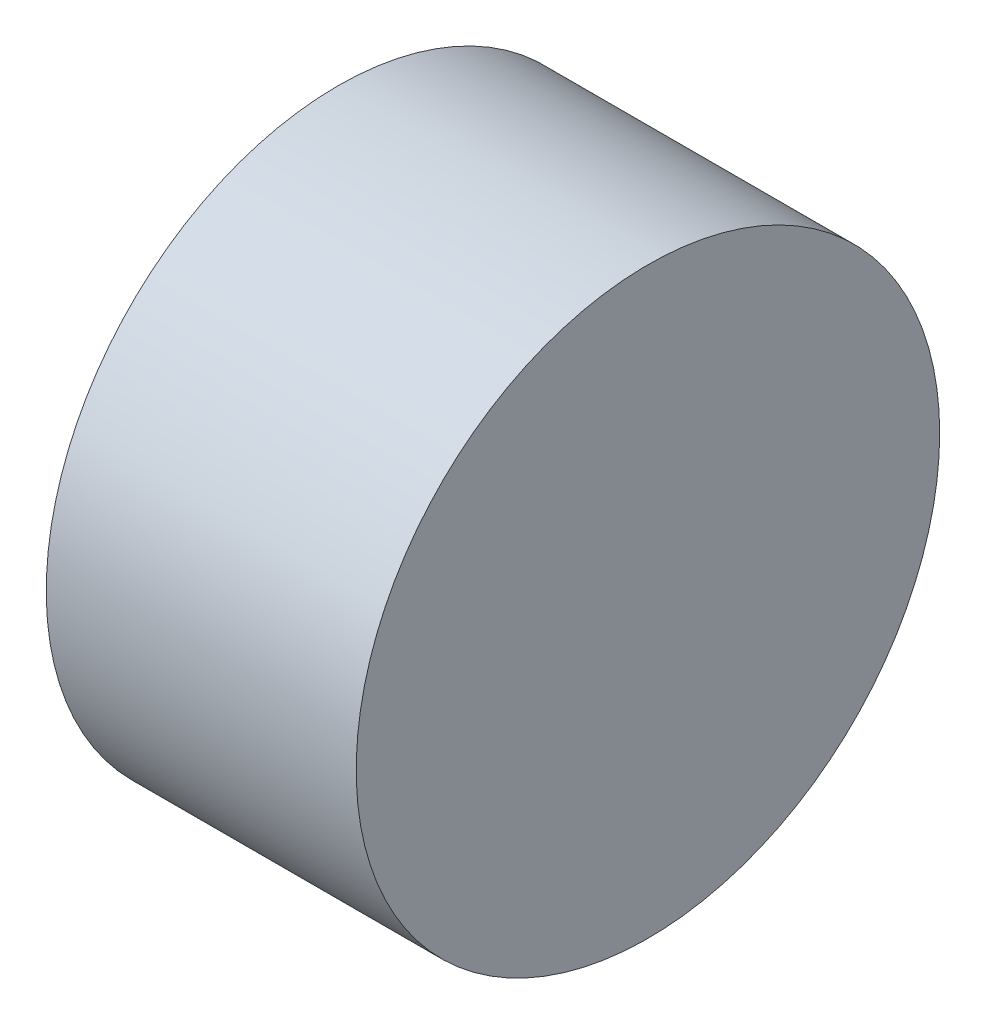
ISO-10303-21;
HEADER;
FILE_DESCRIPTION(('STEP AP214'),'2;1');
FILE_NAME('part.step','',(''),(''),'','','');
FILE_SCHEMA(('AUTOMOTIVE_DESIGN { 1 0 10303 214 1 1 1 1 }'));
ENDSEC;
DATA;
#1=APPLICATION_CONTEXT('core data for automotive mechanical design processes');
#2=APPLICATION_PROTOCOL_DEFINITION('international standard','automotive_design',2000,#1);
#3=PRODUCT_CONTEXT('',#1,'mechanical');
#4=PRODUCT('Part','Part','',(#3));
#5=PRODUCT_RELATED_PRODUCT_CATEGORY('part','',(#4));
#6=PRODUCT_DEFINITION_FORMATION('','',#4);
#7=PRODUCT_DEFINITION_CONTEXT('part definition',#1,'design');
#8=PRODUCT_DEFINITION('design','',#6,#7);
#9=PRODUCT_DEFINITION_SHAPE('','',#8);
#10=(LENGTH_UNIT() NAMED_UNIT(*) SI_UNIT(.MILLI.,.METRE.));
#11=(NAMED_UNIT(*) PLANE_ANGLE_UNIT() SI_UNIT($,.RADIAN.));
#12=(NAMED_UNIT(*) SI_UNIT($,.STERADIAN.) SOLID_ANGLE_UNIT());
#13=UNCERTAINTY_MEASURE_WITH_UNIT(LENGTH_MEASURE(1.E-05),#10,'distance_accuracy_value','');
#14=(GEOMETRIC_REPRESENTATION_CONTEXT(3) GLOBAL_UNCERTAINTY_ASSIGNED_CONTEXT((#13)) GLOBAL_UNIT_ASSIGNED_CONTEXT((#10,
#11,#12)) REPRESENTATION_CONTEXT('',''));
#15=CARTESIAN_POINT('',(0.,0.,0.));
#16=DIRECTION('',(0.,0.,1.));
#17=DIRECTION('',(1.,0.,0.));
#18=AXIS2_PLACEMENT_3D('',#15,#16,#17);
#19=CARTESIAN_POINT('',(-14.8137084989848,0.,0.));
#20=DIRECTION('',(1.,0.,0.));
#21=DIRECTION('',(0.,0.,-1.));
#22=AXIS2_PLACEMENT_3D('',#19,#20,#21);
#23=CYLINDRICAL_SURFACE('',#22,4.);
#24=CARTESIAN_POINT('',(-3.25,0.,0.));
#25=DIRECTION('',(1.,0.,0.));
#26=DIRECTION('',(0.,1.,0.));
#27=AXIS2_PLACEMENT_3D('',#24,#25,#26);
#28=CIRCLE('',#27,4.);
#29=CARTESIAN_POINT('',(-3.25,4.,0.));
#30=VERTEX_POINT('',#29);
#31=EDGE_CURVE('E12',#30,#30,#28,.F.);
#32=ORIENTED_EDGE('',*,*,#31,.F.);
#33=EDGE_LOOP('',(#32));
#34=FACE_BOUND('',#33,.T.);
#35=CARTESIAN_POINT('',(1.,0.,0.));
#36=DIRECTION('',(1.,0.,0.));
#37=DIRECTION('',(0.,0.,-1.));
#38=AXIS2_PLACEMENT_3D('',#35,#36,#37);
#39=CIRCLE('',#38,4.);
#40=CARTESIAN_POINT('',(1.,0.,-4.00000000000001));
#41=VERTEX_POINT('',#40);
#42=EDGE_CURVE('E89',#41,#41,#39,.T.);
#43=ORIENTED_EDGE('',*,*,#42,.F.);
#44=EDGE_LOOP('',(#43));
#45=FACE_BOUND('',#44,.T.);
#46=ADVANCED_FACE('F46',(#34,#45),#23,.T.);
#47=CARTESIAN_POINT('',(-14.8137084989848,-2.157,1.52735064736296));
#48=DIRECTION('',(0.,-1.,0.));
#49=DIRECTION('',(0.,0.,-1.));
#50=AXIS2_PLACEMENT_3D('',#47,#48,#49);
#51=PLANE('',#50);
#52=DIRECTION('',(1.,0.,0.));
#53=VECTOR('',#52,1.);
#54=CARTESIAN_POINT('',(-14.8137084989848,-2.157,-1.52735064736297));
#55=LINE('',#54,#53);
#56=CARTESIAN_POINT('',(-3.25,-2.157,-1.52735064736297));
#57=VERTEX_POINT('',#56);
#58=CARTESIAN_POINT('',(0.,-2.157,-1.52735064736297));
#59=VERTEX_POINT('',#58);
#60=EDGE_CURVE('E86',#57,#59,#55,.T.);
#61=ORIENTED_EDGE('',*,*,#60,.F.);
#62=DIRECTION('',(0.,0.,1.));
#63=VECTOR('',#62,1.);
#64=CARTESIAN_POINT('',(-3.25,-2.157,1.52735064736296));
#65=LINE('',#64,#63);
#66=CARTESIAN_POINT('',(-3.25,-2.157,1.52735064736296));
#67=VERTEX_POINT('',#66);
#68=EDGE_CURVE('E49',#57,#67,#65,.T.);
#69=ORIENTED_EDGE('',*,*,#68,.T.);
#70=DIRECTION('',(1.,0.,0.));
#71=VECTOR('',#70,1.);
#72=CARTESIAN_POINT('',(-14.8137084989848,-2.157,1.52735064736296));
#73=LINE('',#72,#71);
#74=CARTESIAN_POINT('',(0.,-2.157,1.52735064736296));
#75=VERTEX_POINT('',#74);
#76=EDGE_CURVE('E81',#67,#75,#73,.T.);
#77=ORIENTED_EDGE('',*,*,#76,.T.);
#78=DIRECTION('',(0.,0.,-1.));
#79=VECTOR('',#78,1.);
#80=CARTESIAN_POINT('',(0.,-2.157,1.52735064736296));
#81=LINE('',#80,#79);
#82=EDGE_CURVE('E72',#75,#59,#81,.T.);
#83=ORIENTED_EDGE('',*,*,#82,.T.);
#84=EDGE_LOOP('',(#61,#69,#77,#83));
#85=FACE_BOUND('',#84,.T.);
#86=ADVANCED_FACE('F83',(#85),#51,.F.);
#87=CARTESIAN_POINT('',(-14.8137084989848,0.,0.));
#88=DIRECTION('',(1.,0.,0.));
#89=DIRECTION('',(0.,0.,-1.));
#90=AXIS2_PLACEMENT_3D('',#87,#88,#89);
#91=CYLINDRICAL_SURFACE('',#90,2.64300000000001);
#92=ORIENTED_EDGE('',*,*,#76,.F.);
#93=CARTESIAN_POINT('',(-3.25,0.,0.));
#94=DIRECTION('',(1.,0.,0.));
#95=DIRECTION('',(0.,1.,0.));
#96=AXIS2_PLACEMENT_3D('',#93,#94,#95);
#97=CIRCLE('',#96,2.64300000000001);
#98=EDGE_CURVE('E55',#67,#57,#97,.F.);
#99=ORIENTED_EDGE('',*,*,#98,.T.);
#100=ORIENTED_EDGE('',*,*,#60,.T.);
#101=CARTESIAN_POINT('',(0.,0.,0.));
#102=DIRECTION('',(1.,0.,0.));
#103=DIRECTION('',(0.,0.,-1.));
#104=AXIS2_PLACEMENT_3D('',#101,#102,#103);
#105=CIRCLE('',#104,2.64300000000001);
#106=EDGE_CURVE('E76',#59,#75,#105,.T.);
#107=ORIENTED_EDGE('',*,*,#106,.T.);
#108=EDGE_LOOP('',(#92,#99,#100,#107));
#109=FACE_BOUND('',#108,.T.);
#110=ADVANCED_FACE('F87',(#109),#91,.F.);
#111=CARTESIAN_POINT('',(-3.25,0.,0.));
#112=DIRECTION('',(1.,0.,0.));
#113=DIRECTION('',(0.,0.292430258224602,-0.956286852400833));
#114=AXIS2_PLACEMENT_3D('',#111,#112,#113);
#115=PLANE('',#114);
#116=ORIENTED_EDGE('',*,*,#31,.T.);
#117=EDGE_LOOP('',(#116));
#118=FACE_BOUND('',#117,.T.);
#119=ORIENTED_EDGE('',*,*,#68,.F.);
#120=ORIENTED_EDGE('',*,*,#98,.F.);
#121=EDGE_LOOP('',(#119,#120));
#122=FACE_BOUND('',#121,.T.);
#123=ADVANCED_FACE('F112',(#118,#122),#115,.F.);
#124=CARTESIAN_POINT('',(0.,0.,0.));
#125=DIRECTION('',(1.,0.,0.));
#126=DIRECTION('',(0.,0.,-1.));
#127=AXIS2_PLACEMENT_3D('',#124,#125,#126);
#128=PLANE('',#127);
#129=ORIENTED_EDGE('',*,*,#106,.F.);
#130=ORIENTED_EDGE('',*,*,#82,.F.);
#131=EDGE_LOOP('',(#129,#130));
#132=FACE_BOUND('',#131,.T.);
#133=ADVANCED_FACE('F74',(#132),#128,.F.);
#134=CARTESIAN_POINT('',(1.,0.,0.));
#135=DIRECTION('',(1.,0.,0.));
#136=DIRECTION('',(0.,0.,-1.));
#137=AXIS2_PLACEMENT_3D('',#134,#135,#136);
#138=PLANE('',#137);
#139=ORIENTED_EDGE('',*,*,#42,.T.);
#140=EDGE_LOOP('',(#139));
#141=FACE_BOUND('',#140,.T.);
#142=ADVANCED_FACE('F101',(#141),#138,.T.);
#143=CLOSED_SHELL('',(#46,#86,#110,#123,#133,#142));
#144=MANIFOLD_SOLID_BREP('B2',#143);
#145=ADVANCED_BREP_SHAPE_REPRESENTATION('',(#18,#144),#14);
#146=SHAPE_DEFINITION_REPRESENTATION(#9,#145);
ENDSEC;
END-ISO-10303-21;
